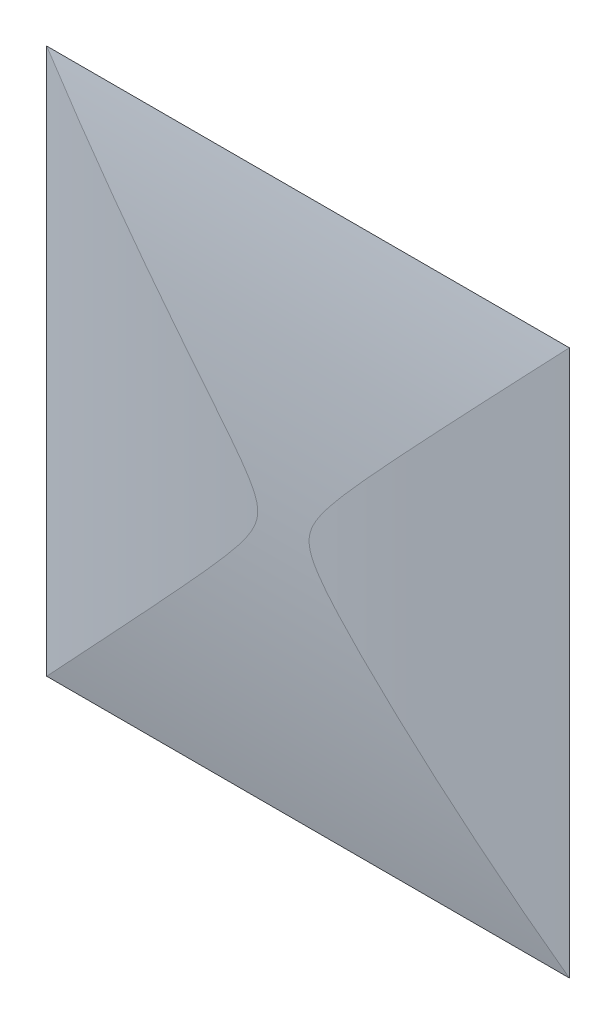
ISO-10303-21;
HEADER;
FILE_DESCRIPTION(('STEP AP214'),'2;1');
FILE_NAME('part.step','',(''),(''),'','','');
FILE_SCHEMA(('AUTOMOTIVE_DESIGN { 1 0 10303 214 1 1 1 1 }'));
ENDSEC;
DATA;
#1=APPLICATION_CONTEXT('core data for automotive mechanical design processes');
#2=APPLICATION_PROTOCOL_DEFINITION('international standard','automotive_design',2000,#1);
#3=PRODUCT_CONTEXT('',#1,'mechanical');
#4=PRODUCT('Part','Part','',(#3));
#5=PRODUCT_RELATED_PRODUCT_CATEGORY('part','',(#4));
#6=PRODUCT_DEFINITION_FORMATION('','',#4);
#7=PRODUCT_DEFINITION_CONTEXT('part definition',#1,'design');
#8=PRODUCT_DEFINITION('design','',#6,#7);
#9=PRODUCT_DEFINITION_SHAPE('','',#8);
#10=(LENGTH_UNIT() NAMED_UNIT(*) SI_UNIT(.MILLI.,.METRE.));
#11=(NAMED_UNIT(*) PLANE_ANGLE_UNIT() SI_UNIT($,.RADIAN.));
#12=(NAMED_UNIT(*) SI_UNIT($,.STERADIAN.) SOLID_ANGLE_UNIT());
#13=UNCERTAINTY_MEASURE_WITH_UNIT(LENGTH_MEASURE(1.E-05),#10,'distance_accuracy_value','');
#14=(GEOMETRIC_REPRESENTATION_CONTEXT(3) GLOBAL_UNCERTAINTY_ASSIGNED_CONTEXT((#13)) GLOBAL_UNIT_ASSIGNED_CONTEXT((#10,
#11,#12)) REPRESENTATION_CONTEXT('',''));
#15=CARTESIAN_POINT('',(0.,0.,0.));
#16=DIRECTION('',(0.,0.,1.));
#17=DIRECTION('',(1.,0.,0.));
#18=AXIS2_PLACEMENT_3D('',#15,#16,#17);
#19=CARTESIAN_POINT('',(0.,5.9,-29.4631549566573));
#20=DIRECTION('',(0.,-1.,0.));
#21=DIRECTION('',(0.,0.,-1.));
#22=AXIS2_PLACEMENT_3D('',#19,#20,#21);
#23=CYLINDRICAL_SURFACE('',#22,30.);
#24=CARTESIAN_POINT('',(-5.64999999999999,5.89999999999999,0.));
#25=CARTESIAN_POINT('',(-5.29426620844304,5.52443379328555,0.0682304631745515));
#26=CARTESIAN_POINT('',(-4.93790613054419,5.14824230884676,0.129875049135128));
#27=CARTESIAN_POINT('',(-4.2248751650056,4.39428686508257,0.240049647832839));
#28=CARTESIAN_POINT('',(-3.8682043007127,4.01652301697058,0.288580572616713));
#29=CARTESIAN_POINT('',(-3.2656242346295,3.3761411971242,0.359607404113113));
#30=CARTESIAN_POINT('',(-3.01956312155039,3.11403200300743,0.385513694206319));
#31=CARTESIAN_POINT('',(-2.52853421005977,2.5881665647616,0.431114184320105));
#32=CARTESIAN_POINT('',(-2.28356644188067,2.32441027556612,0.450808213599911));
#33=CARTESIAN_POINT('',(-1.76403935498809,1.7584917575266,0.486208457243501));
#34=CARTESIAN_POINT('',(-1.48990874100798,1.45591496198826,0.501027878809842));
#35=CARTESIAN_POINT('',(-1.08007124118277,0.975503460414264,0.517730821651501));
#36=CARTESIAN_POINT('',(-0.938224935728338,0.803676105666016,0.522431724726856));
#37=CARTESIAN_POINT('',(-0.775278597070685,0.568561393600206,0.526849537986672));
#38=CARTESIAN_POINT('',(-0.740240377802078,0.515309761411648,0.527729320763384));
#39=CARTESIAN_POINT('',(-0.67529673544522,0.40563889037365,0.52926056468507));
#40=CARTESIAN_POINT('',(-0.645387032924806,0.349222345142163,0.529912216668889));
#41=CARTESIAN_POINT('',(-0.604765793775309,0.25370018194969,0.530753033912578));
#42=CARTESIAN_POINT('',(-0.591046520203237,0.215920803922602,0.531024101694988));
#43=CARTESIAN_POINT('',(-0.569632406812232,0.138751081166876,0.531438471358115));
#44=CARTESIAN_POINT('',(-0.561913471093713,0.0993678552422285,0.531582284587635));
#45=CARTESIAN_POINT('',(-0.554169999123488,0.0193171785777539,0.531726552589206));
#46=CARTESIAN_POINT('',(-0.554237670205023,-0.0213599574740654,0.531725289397619));
#47=CARTESIAN_POINT('',(-0.562298970347579,-0.101926064891581,0.531575113701514));
#48=CARTESIAN_POINT('',(-0.570307105760367,-0.14181345744688,0.531425930964324));
#49=CARTESIAN_POINT('',(-0.597323962567807,-0.237540592961923,0.530901847784513));
#50=CARTESIAN_POINT('',(-0.619680555079418,-0.29237828862817,0.530455118500592));
#51=CARTESIAN_POINT('',(-0.671453432681581,-0.398772874910502,0.529341470405742));
#52=CARTESIAN_POINT('',(-0.700916700736538,-0.450304913905719,0.528673074619743));
#53=CARTESIAN_POINT('',(-0.805861166187848,-0.619502913501654,0.526107963212005));
#54=CARTESIAN_POINT('',(-0.889497223917771,-0.731940020799004,0.523775861951239));
#55=CARTESIAN_POINT('',(-1.06265806630136,-0.952223791493844,0.518148243736221));
#56=CARTESIAN_POINT('',(-1.15220007145721,-1.06005537089268,0.514849803367705));
#57=CARTESIAN_POINT('',(-1.33444313915945,-1.27376448594351,0.507289848731035));
#58=CARTESIAN_POINT('',(-1.42715491334073,-1.3796330389137,0.503024722334585));
#59=CARTESIAN_POINT('',(-1.61382433979875,-1.58990319266834,0.49355285358193));
#60=CARTESIAN_POINT('',(-1.70777990029236,-1.69430676649432,0.488347542237168));
#61=CARTESIAN_POINT('',(-2.11945429508096,-2.14844613510856,0.46356728439645));
#62=CARTESIAN_POINT('',(-2.44093325436669,-2.49452393827929,0.439119163697061));
#63=CARTESIAN_POINT('',(-3.0856204058469,-3.18460239344509,0.379505483157299));
#64=CARTESIAN_POINT('',(-3.40882977498562,-3.52860116373535,0.344331371125244));
#65=CARTESIAN_POINT('',(-4.05208818502409,-4.21134271509761,0.263674187593049));
#66=CARTESIAN_POINT('',(-4.37213378302413,-4.55010220762505,0.218306193376714));
#67=CARTESIAN_POINT('',(-5.01161738588913,-5.22607325001869,0.117051214966794));
#68=CARTESIAN_POINT('',(-5.33105567554953,-5.56328586455841,0.0611731359139267));
#69=CARTESIAN_POINT('',(-5.65000000000003,-5.89999999999999,0.));
#70=B_SPLINE_CURVE_WITH_KNOTS('',3,(#24,#25,#26,#27,#28,#29,#30,#31,#32,#33,#34,#35,#36,#37,#38,
#39,#40,#41,#42,#43,#44,#45,#46,#47,#48,#49,#50,#51,#52,#53,#54,#55,#56,#57,#58,#59,#60,#61,#62,
#63,#64,#65,#66,#67,#68,#69),.UNSPECIFIED.,.F.,.F.,(4,2,2,2,2,2,2,2,2,2,2,2,2,2,2,2,2,2,2,2,2,2,
4),(0.,1.56532343835859,3.1305379814368,4.21184228782355,5.29317631071049,6.51926896669257,
7.18648128357946,7.37761438832551,7.56858721977719,7.68883874052508,7.80860482929707,
7.92978930676822,8.05119558356441,8.22785770033335,8.40572140254105,8.82513650985966,
9.24583378973398,9.66812975378745,10.0897882958514,11.5085267607072,12.9283994041754,
14.332983888513,15.7363835934172),.UNSPECIFIED.);
#71=CARTESIAN_POINT('',(-5.65,5.9,0.));
#72=VERTEX_POINT('',#71);
#73=CARTESIAN_POINT('',(-5.65,-5.9,0.));
#74=VERTEX_POINT('',#73);
#75=EDGE_CURVE('E11',#72,#74,#70,.T.);
#76=ORIENTED_EDGE('',*,*,#75,.F.);
#77=DIRECTION('',(0.,-1.,0.));
#78=VECTOR('',#77,1.);
#79=CARTESIAN_POINT('',(-5.65,5.9,0.));
#80=LINE('',#79,#78);
#81=EDGE_CURVE('E71',#72,#74,#80,.T.);
#82=ORIENTED_EDGE('',*,*,#81,.T.);
#83=EDGE_LOOP('',(#76,#82));
#84=FACE_BOUND('',#83,.T.);
#85=ADVANCED_FACE('F33',(#84),#23,.T.);
#86=CARTESIAN_POINT('',(-5.65,-5.9,0.));
#87=DIRECTION('',(0.,0.,1.));
#88=DIRECTION('',(1.,0.,0.));
#89=AXIS2_PLACEMENT_3D('',#86,#87,#88);
#90=PLANE('',#89);
#91=ORIENTED_EDGE('',*,*,#81,.F.);
#92=DIRECTION('',(-1.,0.,0.));
#93=VECTOR('',#92,1.);
#94=CARTESIAN_POINT('',(-5.65,5.9,0.));
#95=LINE('',#94,#93);
#96=CARTESIAN_POINT('',(5.65,5.9,0.));
#97=VERTEX_POINT('',#96);
#98=EDGE_CURVE('E63',#97,#72,#95,.T.);
#99=ORIENTED_EDGE('',*,*,#98,.F.);
#100=DIRECTION('',(0.,1.,0.));
#101=VECTOR('',#100,1.);
#102=CARTESIAN_POINT('',(5.65,5.9,0.));
#103=LINE('',#102,#101);
#104=CARTESIAN_POINT('',(5.65,-5.9,0.));
#105=VERTEX_POINT('',#104);
#106=EDGE_CURVE('E66',#105,#97,#103,.T.);
#107=ORIENTED_EDGE('',*,*,#106,.F.);
#108=DIRECTION('',(1.,0.,0.));
#109=VECTOR('',#108,1.);
#110=CARTESIAN_POINT('',(-5.65,-5.9,0.));
#111=LINE('',#110,#109);
#112=EDGE_CURVE('E51',#74,#105,#111,.T.);
#113=ORIENTED_EDGE('',*,*,#112,.F.);
#114=EDGE_LOOP('',(#91,#99,#107,#113));
#115=FACE_BOUND('',#114,.T.);
#116=ADVANCED_FACE('F35',(#115),#90,.F.);
#117=CARTESIAN_POINT('',(5.65,-5.89999999999999,0.));
#118=CARTESIAN_POINT('',(5.29426620844295,-5.5244337932854,0.068230463174573));
#119=CARTESIAN_POINT('',(4.93790613054397,-5.14824230884649,0.129875049135168));
#120=CARTESIAN_POINT('',(4.2248751650051,-4.39428686508204,0.240049647832911));
#121=CARTESIAN_POINT('',(3.86820430071204,-4.0165230169699,0.288580572616797));
#122=CARTESIAN_POINT('',(3.26562423462844,-3.3761411971231,0.35960740411323));
#123=CARTESIAN_POINT('',(3.01956312154909,-3.11403200300605,0.385513694206455));
#124=CARTESIAN_POINT('',(2.52853421005795,-2.58816656475971,0.431114184320262));
#125=CARTESIAN_POINT('',(2.28356644187858,-2.324410275564,0.450808213600072));
#126=CARTESIAN_POINT('',(1.76403935498583,-1.75849175752423,0.486208457243631));
#127=CARTESIAN_POINT('',(1.48990874100584,-1.45591496198586,0.501027878809944));
#128=CARTESIAN_POINT('',(1.08007124118107,-0.975503460412265,0.517730821651565));
#129=CARTESIAN_POINT('',(0.938224935726978,-0.803676105664423,0.522431724726905));
#130=CARTESIAN_POINT('',(0.775278597069747,-0.568561393599024,0.526849537986697));
#131=CARTESIAN_POINT('',(0.740240377801216,-0.515309761410521,0.527729320763404));
#132=CARTESIAN_POINT('',(0.67529673544475,-0.405638890372526,0.52926056468508));
#133=CARTESIAN_POINT('',(0.645387032924654,-0.349222345140986,0.529912216668894));
#134=CARTESIAN_POINT('',(0.604765793774941,-0.253700181948671,0.530753033912585));
#135=CARTESIAN_POINT('',(0.591046520202605,-0.215920803921692,0.531024101694999));
#136=CARTESIAN_POINT('',(0.569632406811535,-0.13875108116605,0.531438471358126));
#137=CARTESIAN_POINT('',(0.561913471093208,-0.0993678552413787,0.531582284587643));
#138=CARTESIAN_POINT('',(0.554169999123365,-0.0193171785769263,0.531726552589206));
#139=CARTESIAN_POINT('',(0.55423767020509,0.0213599574748462,0.531725289397615));
#140=CARTESIAN_POINT('',(0.562298970347852,0.1019260648923,0.531575113701509));
#141=CARTESIAN_POINT('',(0.570307105760664,0.141813457447584,0.531425930964322));
#142=CARTESIAN_POINT('',(0.597323962568225,0.23754059296276,0.530901847784511));
#143=CARTESIAN_POINT('',(0.619680555079983,0.292378288629136,0.53045511850058));
#144=CARTESIAN_POINT('',(0.671453432682296,0.398772874911758,0.529341470405722));
#145=CARTESIAN_POINT('',(0.700916700737252,0.450304913907139,0.528673074619725));
#146=CARTESIAN_POINT('',(0.805861166188763,0.619502913503463,0.526107963211984));
#147=CARTESIAN_POINT('',(0.889497223919179,0.731940020800853,0.523775861951203));
#148=CARTESIAN_POINT('',(1.06265806630335,0.952223791496068,0.518148243736157));
#149=CARTESIAN_POINT('',(1.1522000714593,1.06005537089524,0.514849803367627));
#150=CARTESIAN_POINT('',(1.33444313916194,1.27376448594669,0.507289848730922));
#151=CARTESIAN_POINT('',(1.42715491334352,1.37963303891717,0.503024722334449));
#152=CARTESIAN_POINT('',(1.61382433980216,1.58990319267233,0.493552853581743));
#153=CARTESIAN_POINT('',(1.7077799002961,1.69430676649854,0.488347542236954));
#154=CARTESIAN_POINT('',(2.11945429508499,2.14844613511268,0.463567284396169));
#155=CARTESIAN_POINT('',(2.44093325437046,2.49452393828327,0.439119163696754));
#156=CARTESIAN_POINT('',(3.08562040585025,3.18460239344871,0.379505483156947));
#157=CARTESIAN_POINT('',(3.40882977498881,3.52860116373875,0.344331371124873));
#158=CARTESIAN_POINT('',(4.05208818502661,4.21134271510026,0.263674187592697));
#159=CARTESIAN_POINT('',(4.37213378302614,4.55010220762717,0.21830619337641));
#160=CARTESIAN_POINT('',(5.01161738589011,5.22607325001977,0.117051214966618));
#161=CARTESIAN_POINT('',(5.33105567555001,5.56328586455896,0.0611731359138327));
#162=CARTESIAN_POINT('',(5.65000000000001,5.89999999999999,0.));
#163=B_SPLINE_CURVE_WITH_KNOTS('',3,(#117,#118,#119,#120,#121,#122,#123,#124,#125,#126,#127,
#128,#129,#130,#131,#132,#133,#134,#135,#136,#137,#138,#139,#140,#141,#142,#143,#144,#145,#146,
#147,#148,#149,#150,#151,#152,#153,#154,#155,#156,#157,#158,#159,#160,#161,#162),.UNSPECIFIED.,
.F.,.F.,(4,2,2,2,2,2,2,2,2,2,2,2,2,2,2,2,2,2,2,2,2,2,4),(0.,1.56532343835913,3.13053798143797,
4.21184228782583,5.29317631071383,6.51926896669572,7.18648128358108,7.37761438832682,
7.56858721977828,7.68883874052613,7.80860482929802,7.92978930676906,8.05119558356524,
8.2278577003347,8.40572140254283,8.82513650986238,9.24583378973768,9.66812975379236,
10.0897882958575,11.5085267607125,12.9283994041799,14.3329838885153,15.7363835934172),.UNSPECIFIED.);
#164=EDGE_CURVE('E45',#105,#97,#163,.T.);
#165=ORIENTED_EDGE('',*,*,#164,.F.);
#166=ORIENTED_EDGE('',*,*,#106,.T.);
#167=EDGE_LOOP('',(#165,#166));
#168=FACE_BOUND('',#167,.T.);
#169=ADVANCED_FACE('F67',(#168),#23,.T.);
#170=CARTESIAN_POINT('',(-5.65,0.,-32.4682922248769));
#171=DIRECTION('',(1.,0.,0.));
#172=DIRECTION('',(0.,0.,-1.));
#173=AXIS2_PLACEMENT_3D('',#170,#171,#172);
#174=CYLINDRICAL_SURFACE('',#173,33.);
#175=ORIENTED_EDGE('',*,*,#75,.T.);
#176=ORIENTED_EDGE('',*,*,#112,.T.);
#177=ORIENTED_EDGE('',*,*,#164,.T.);
#178=ORIENTED_EDGE('',*,*,#98,.T.);
#179=EDGE_LOOP('',(#175,#176,#177,#178));
#180=FACE_BOUND('',#179,.T.);
#181=ADVANCED_FACE('F61',(#180),#174,.T.);
#182=CLOSED_SHELL('',(#85,#116,#169,#181));
#183=MANIFOLD_SOLID_BREP('B2',#182);
#184=ADVANCED_BREP_SHAPE_REPRESENTATION('',(#18,#183),#14);
#185=SHAPE_DEFINITION_REPRESENTATION(#9,#184);
ENDSEC;
END-ISO-10303-21;
